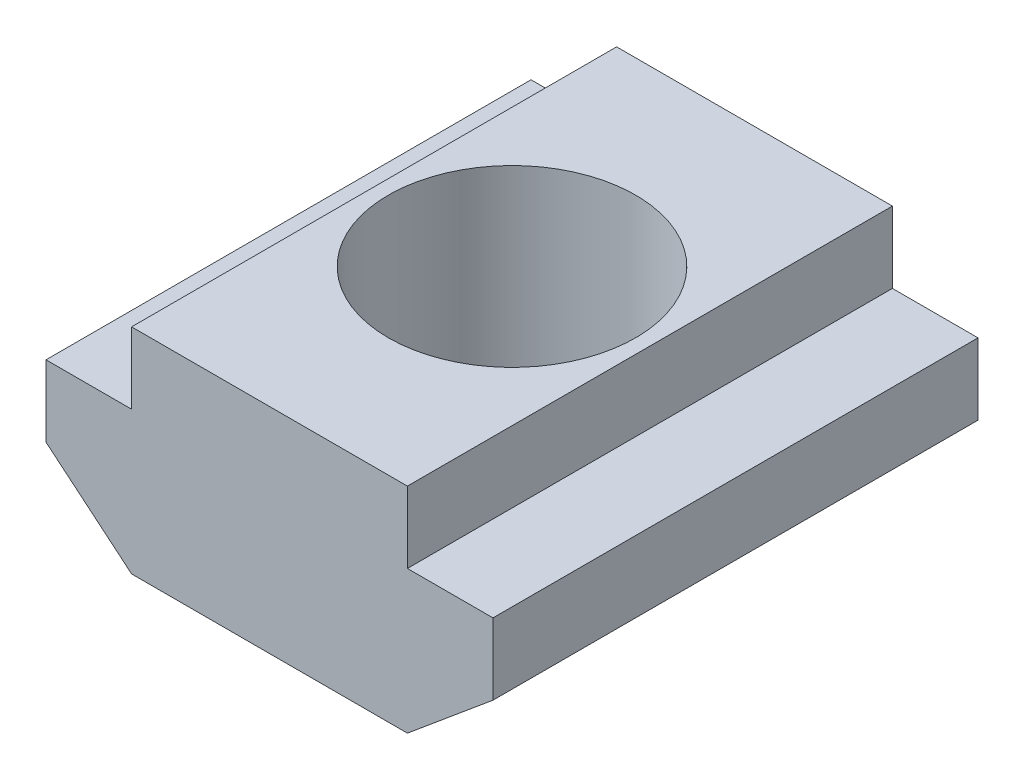
ISO-10303-21;
HEADER;
FILE_DESCRIPTION(('STEP AP214'),'2;1');
FILE_NAME('part.step','',(''),(''),'','','');
FILE_SCHEMA(('AUTOMOTIVE_DESIGN { 1 0 10303 214 1 1 1 1 }'));
ENDSEC;
DATA;
#1=APPLICATION_CONTEXT('core data for automotive mechanical design processes');
#2=APPLICATION_PROTOCOL_DEFINITION('international standard','automotive_design',2000,#1);
#3=PRODUCT_CONTEXT('',#1,'mechanical');
#4=PRODUCT('Part','Part','',(#3));
#5=PRODUCT_RELATED_PRODUCT_CATEGORY('part','',(#4));
#6=PRODUCT_DEFINITION_FORMATION('','',#4);
#7=PRODUCT_DEFINITION_CONTEXT('part definition',#1,'design');
#8=PRODUCT_DEFINITION('design','',#6,#7);
#9=PRODUCT_DEFINITION_SHAPE('','',#8);
#10=(LENGTH_UNIT() NAMED_UNIT(*) SI_UNIT(.MILLI.,.METRE.));
#11=(NAMED_UNIT(*) PLANE_ANGLE_UNIT() SI_UNIT($,.RADIAN.));
#12=(NAMED_UNIT(*) SI_UNIT($,.STERADIAN.) SOLID_ANGLE_UNIT());
#13=UNCERTAINTY_MEASURE_WITH_UNIT(LENGTH_MEASURE(1.E-05),#10,'distance_accuracy_value','');
#14=(GEOMETRIC_REPRESENTATION_CONTEXT(3) GLOBAL_UNCERTAINTY_ASSIGNED_CONTEXT((#13)) GLOBAL_UNIT_ASSIGNED_CONTEXT((#10,
#11,#12)) REPRESENTATION_CONTEXT('',''));
#15=CARTESIAN_POINT('',(0.,0.,0.));
#16=DIRECTION('',(0.,0.,1.));
#17=DIRECTION('',(1.,0.,0.));
#18=AXIS2_PLACEMENT_3D('',#15,#16,#17);
#19=CARTESIAN_POINT('',(1.8,3.,10.2));
#20=DIRECTION('',(0.,-1.,0.));
#21=DIRECTION('',(0.,0.,-1.));
#22=AXIS2_PLACEMENT_3D('',#19,#20,#21);
#23=PLANE('',#22);
#24=DIRECTION('',(-1.,0.,0.));
#25=VECTOR('',#24,1.);
#26=CARTESIAN_POINT('',(1.8,3.,0.));
#27=LINE('',#26,#25);
#28=CARTESIAN_POINT('',(1.8,3.,0.));
#29=VERTEX_POINT('',#28);
#30=CARTESIAN_POINT('',(0.,3.,0.));
#31=VERTEX_POINT('',#30);
#32=EDGE_CURVE('E143',#29,#31,#27,.T.);
#33=ORIENTED_EDGE('',*,*,#32,.T.);
#34=DIRECTION('',(0.,0.,-1.));
#35=VECTOR('',#34,1.);
#36=CARTESIAN_POINT('',(0.,3.,10.2));
#37=LINE('',#36,#35);
#38=CARTESIAN_POINT('',(0.,3.,10.2));
#39=VERTEX_POINT('',#38);
#40=EDGE_CURVE('E11',#39,#31,#37,.T.);
#41=ORIENTED_EDGE('',*,*,#40,.F.);
#42=DIRECTION('',(-1.,0.,0.));
#43=VECTOR('',#42,1.);
#44=CARTESIAN_POINT('',(1.8,3.,10.2));
#45=LINE('',#44,#43);
#46=CARTESIAN_POINT('',(1.8,3.,10.2));
#47=VERTEX_POINT('',#46);
#48=EDGE_CURVE('E162',#47,#39,#45,.T.);
#49=ORIENTED_EDGE('',*,*,#48,.F.);
#50=DIRECTION('',(0.,0.,-1.));
#51=VECTOR('',#50,1.);
#52=CARTESIAN_POINT('',(1.8,3.,10.2));
#53=LINE('',#52,#51);
#54=EDGE_CURVE('E139',#47,#29,#53,.T.);
#55=ORIENTED_EDGE('',*,*,#54,.T.);
#56=EDGE_LOOP('',(#33,#41,#49,#55));
#57=FACE_BOUND('',#56,.T.);
#58=ADVANCED_FACE('F35',(#57),#23,.F.);
#59=CARTESIAN_POINT('',(0.,3.,10.2));
#60=DIRECTION('',(1.,0.,0.));
#61=DIRECTION('',(0.,0.,-1.));
#62=AXIS2_PLACEMENT_3D('',#59,#60,#61);
#63=PLANE('',#62);
#64=DIRECTION('',(0.,-1.,0.));
#65=VECTOR('',#64,1.);
#66=CARTESIAN_POINT('',(0.,3.,0.));
#67=LINE('',#66,#65);
#68=CARTESIAN_POINT('',(0.,1.5,0.));
#69=VERTEX_POINT('',#68);
#70=EDGE_CURVE('E146',#31,#69,#67,.T.);
#71=ORIENTED_EDGE('',*,*,#70,.T.);
#72=DIRECTION('',(0.,0.,-1.));
#73=VECTOR('',#72,1.);
#74=CARTESIAN_POINT('',(0.,1.5,10.2));
#75=LINE('',#74,#73);
#76=CARTESIAN_POINT('',(0.,1.5,10.2));
#77=VERTEX_POINT('',#76);
#78=EDGE_CURVE('E43',#77,#69,#75,.T.);
#79=ORIENTED_EDGE('',*,*,#78,.F.);
#80=DIRECTION('',(0.,-1.,0.));
#81=VECTOR('',#80,1.);
#82=CARTESIAN_POINT('',(0.,3.,10.2));
#83=LINE('',#82,#81);
#84=EDGE_CURVE('E100',#39,#77,#83,.T.);
#85=ORIENTED_EDGE('',*,*,#84,.F.);
#86=ORIENTED_EDGE('',*,*,#40,.T.);
#87=EDGE_LOOP('',(#71,#79,#85,#86));
#88=FACE_BOUND('',#87,.T.);
#89=ADVANCED_FACE('F228',(#88),#63,.F.);
#90=CARTESIAN_POINT('',(0.,1.5,10.2));
#91=DIRECTION('',(0.64018439966448,0.768221279597376,0.));
#92=DIRECTION('',(-0.768221279597376,0.64018439966448,0.));
#93=AXIS2_PLACEMENT_3D('',#90,#91,#92);
#94=PLANE('',#93);
#95=DIRECTION('',(0.768221279597376,-0.64018439966448,0.));
#96=VECTOR('',#95,1.);
#97=CARTESIAN_POINT('',(0.,1.5,0.));
#98=LINE('',#97,#96);
#99=CARTESIAN_POINT('',(1.8,0.,0.));
#100=VERTEX_POINT('',#99);
#101=EDGE_CURVE('E149',#69,#100,#98,.T.);
#102=ORIENTED_EDGE('',*,*,#101,.T.);
#103=DIRECTION('',(0.,0.,-1.));
#104=VECTOR('',#103,1.);
#105=CARTESIAN_POINT('',(1.8,0.,10.2));
#106=LINE('',#105,#104);
#107=CARTESIAN_POINT('',(1.8,0.,10.2));
#108=VERTEX_POINT('',#107);
#109=EDGE_CURVE('E175',#108,#100,#106,.T.);
#110=ORIENTED_EDGE('',*,*,#109,.F.);
#111=DIRECTION('',(0.768221279597376,-0.64018439966448,0.));
#112=VECTOR('',#111,1.);
#113=CARTESIAN_POINT('',(0.,1.5,10.2));
#114=LINE('',#113,#112);
#115=EDGE_CURVE('E183',#77,#108,#114,.T.);
#116=ORIENTED_EDGE('',*,*,#115,.F.);
#117=ORIENTED_EDGE('',*,*,#78,.T.);
#118=EDGE_LOOP('',(#102,#110,#116,#117));
#119=FACE_BOUND('',#118,.T.);
#120=ADVANCED_FACE('F181',(#119),#94,.F.);
#121=CARTESIAN_POINT('',(1.8,0.,10.2));
#122=DIRECTION('',(0.,1.,0.));
#123=DIRECTION('',(0.,0.,1.));
#124=AXIS2_PLACEMENT_3D('',#121,#122,#123);
#125=PLANE('',#124);
#126=CARTESIAN_POINT('',(4.7,0.,5.1));
#127=DIRECTION('',(0.,1.,0.));
#128=DIRECTION('',(0.,0.,1.));
#129=AXIS2_PLACEMENT_3D('',#126,#127,#128);
#130=CIRCLE('',#129,2.6);
#131=CARTESIAN_POINT('',(4.7,0.,7.7));
#132=VERTEX_POINT('',#131);
#133=EDGE_CURVE('E147',#132,#132,#130,.T.);
#134=ORIENTED_EDGE('',*,*,#133,.T.);
#135=EDGE_LOOP('',(#134));
#136=FACE_BOUND('',#135,.T.);
#137=DIRECTION('',(1.,0.,0.));
#138=VECTOR('',#137,1.);
#139=CARTESIAN_POINT('',(1.8,0.,0.));
#140=LINE('',#139,#138);
#141=CARTESIAN_POINT('',(7.6,0.,0.));
#142=VERTEX_POINT('',#141);
#143=EDGE_CURVE('E151',#100,#142,#140,.T.);
#144=ORIENTED_EDGE('',*,*,#143,.T.);
#145=DIRECTION('',(0.,0.,-1.));
#146=VECTOR('',#145,1.);
#147=CARTESIAN_POINT('',(7.6,0.,10.2));
#148=LINE('',#147,#146);
#149=CARTESIAN_POINT('',(7.6,0.,10.2));
#150=VERTEX_POINT('',#149);
#151=EDGE_CURVE('E172',#150,#142,#148,.T.);
#152=ORIENTED_EDGE('',*,*,#151,.F.);
#153=DIRECTION('',(1.,0.,0.));
#154=VECTOR('',#153,1.);
#155=CARTESIAN_POINT('',(1.8,0.,10.2));
#156=LINE('',#155,#154);
#157=EDGE_CURVE('E201',#108,#150,#156,.T.);
#158=ORIENTED_EDGE('',*,*,#157,.F.);
#159=ORIENTED_EDGE('',*,*,#109,.T.);
#160=EDGE_LOOP('',(#144,#152,#158,#159));
#161=FACE_BOUND('',#160,.T.);
#162=ADVANCED_FACE('F192',(#136,#161),#125,.F.);
#163=CARTESIAN_POINT('',(7.6,0.,10.2));
#164=DIRECTION('',(-0.64018439966448,0.768221279597376,0.));
#165=DIRECTION('',(-0.768221279597376,-0.64018439966448,0.));
#166=AXIS2_PLACEMENT_3D('',#163,#164,#165);
#167=PLANE('',#166);
#168=DIRECTION('',(0.768221279597376,0.64018439966448,0.));
#169=VECTOR('',#168,1.);
#170=CARTESIAN_POINT('',(7.6,0.,0.));
#171=LINE('',#170,#169);
#172=CARTESIAN_POINT('',(9.4,1.5,0.));
#173=VERTEX_POINT('',#172);
#174=EDGE_CURVE('E153',#142,#173,#171,.T.);
#175=ORIENTED_EDGE('',*,*,#174,.T.);
#176=DIRECTION('',(0.,0.,-1.));
#177=VECTOR('',#176,1.);
#178=CARTESIAN_POINT('',(9.4,1.5,10.2));
#179=LINE('',#178,#177);
#180=CARTESIAN_POINT('',(9.4,1.5,10.2));
#181=VERTEX_POINT('',#180);
#182=EDGE_CURVE('E169',#181,#173,#179,.T.);
#183=ORIENTED_EDGE('',*,*,#182,.F.);
#184=DIRECTION('',(0.768221279597376,0.64018439966448,0.));
#185=VECTOR('',#184,1.);
#186=CARTESIAN_POINT('',(7.6,0.,10.2));
#187=LINE('',#186,#185);
#188=EDGE_CURVE('E198',#150,#181,#187,.T.);
#189=ORIENTED_EDGE('',*,*,#188,.F.);
#190=ORIENTED_EDGE('',*,*,#151,.T.);
#191=EDGE_LOOP('',(#175,#183,#189,#190));
#192=FACE_BOUND('',#191,.T.);
#193=ADVANCED_FACE('F196',(#192),#167,.F.);
#194=CARTESIAN_POINT('',(9.4,1.5,10.2));
#195=DIRECTION('',(-1.,0.,0.));
#196=DIRECTION('',(0.,0.,1.));
#197=AXIS2_PLACEMENT_3D('',#194,#195,#196);
#198=PLANE('',#197);
#199=DIRECTION('',(0.,1.,0.));
#200=VECTOR('',#199,1.);
#201=CARTESIAN_POINT('',(9.4,1.5,0.));
#202=LINE('',#201,#200);
#203=CARTESIAN_POINT('',(9.4,3.,0.));
#204=VERTEX_POINT('',#203);
#205=EDGE_CURVE('E155',#173,#204,#202,.T.);
#206=ORIENTED_EDGE('',*,*,#205,.T.);
#207=DIRECTION('',(0.,0.,-1.));
#208=VECTOR('',#207,1.);
#209=CARTESIAN_POINT('',(9.4,3.,10.2));
#210=LINE('',#209,#208);
#211=CARTESIAN_POINT('',(9.4,3.,10.2));
#212=VERTEX_POINT('',#211);
#213=EDGE_CURVE('E166',#212,#204,#210,.T.);
#214=ORIENTED_EDGE('',*,*,#213,.F.);
#215=DIRECTION('',(0.,1.,0.));
#216=VECTOR('',#215,1.);
#217=CARTESIAN_POINT('',(9.4,1.5,10.2));
#218=LINE('',#217,#216);
#219=EDGE_CURVE('E200',#181,#212,#218,.T.);
#220=ORIENTED_EDGE('',*,*,#219,.F.);
#221=ORIENTED_EDGE('',*,*,#182,.T.);
#222=EDGE_LOOP('',(#206,#214,#220,#221));
#223=FACE_BOUND('',#222,.T.);
#224=ADVANCED_FACE('F239',(#223),#198,.F.);
#225=CARTESIAN_POINT('',(9.4,3.,10.2));
#226=DIRECTION('',(0.,-1.,0.));
#227=DIRECTION('',(0.,0.,-1.));
#228=AXIS2_PLACEMENT_3D('',#225,#226,#227);
#229=PLANE('',#228);
#230=DIRECTION('',(-1.,0.,0.));
#231=VECTOR('',#230,1.);
#232=CARTESIAN_POINT('',(9.4,3.,0.));
#233=LINE('',#232,#231);
#234=CARTESIAN_POINT('',(7.6,3.,0.));
#235=VERTEX_POINT('',#234);
#236=EDGE_CURVE('E157',#204,#235,#233,.T.);
#237=ORIENTED_EDGE('',*,*,#236,.T.);
#238=DIRECTION('',(0.,0.,-1.));
#239=VECTOR('',#238,1.);
#240=CARTESIAN_POINT('',(7.6,3.,10.2));
#241=LINE('',#240,#239);
#242=CARTESIAN_POINT('',(7.6,3.,10.2));
#243=VERTEX_POINT('',#242);
#244=EDGE_CURVE('E134',#243,#235,#241,.T.);
#245=ORIENTED_EDGE('',*,*,#244,.F.);
#246=DIRECTION('',(-1.,0.,0.));
#247=VECTOR('',#246,1.);
#248=CARTESIAN_POINT('',(9.4,3.,10.2));
#249=LINE('',#248,#247);
#250=EDGE_CURVE('E125',#212,#243,#249,.T.);
#251=ORIENTED_EDGE('',*,*,#250,.F.);
#252=ORIENTED_EDGE('',*,*,#213,.T.);
#253=EDGE_LOOP('',(#237,#245,#251,#252));
#254=FACE_BOUND('',#253,.T.);
#255=ADVANCED_FACE('F225',(#254),#229,.F.);
#256=CARTESIAN_POINT('',(7.6,3.,10.2));
#257=DIRECTION('',(-1.,0.,0.));
#258=DIRECTION('',(0.,-1.,0.));
#259=AXIS2_PLACEMENT_3D('',#256,#257,#258);
#260=PLANE('',#259);
#261=DIRECTION('',(0.,1.,0.));
#262=VECTOR('',#261,1.);
#263=CARTESIAN_POINT('',(7.6,3.,0.));
#264=LINE('',#263,#262);
#265=CARTESIAN_POINT('',(7.6,4.5,0.));
#266=VERTEX_POINT('',#265);
#267=EDGE_CURVE('E133',#235,#266,#264,.T.);
#268=ORIENTED_EDGE('',*,*,#267,.T.);
#269=DIRECTION('',(0.,0.,-1.));
#270=VECTOR('',#269,1.);
#271=CARTESIAN_POINT('',(7.6,4.5,10.2));
#272=LINE('',#271,#270);
#273=CARTESIAN_POINT('',(7.6,4.5,10.2));
#274=VERTEX_POINT('',#273);
#275=EDGE_CURVE('E130',#274,#266,#272,.T.);
#276=ORIENTED_EDGE('',*,*,#275,.F.);
#277=DIRECTION('',(0.,1.,0.));
#278=VECTOR('',#277,1.);
#279=CARTESIAN_POINT('',(7.6,3.,10.2));
#280=LINE('',#279,#278);
#281=EDGE_CURVE('E119',#243,#274,#280,.T.);
#282=ORIENTED_EDGE('',*,*,#281,.F.);
#283=ORIENTED_EDGE('',*,*,#244,.T.);
#284=EDGE_LOOP('',(#268,#276,#282,#283));
#285=FACE_BOUND('',#284,.T.);
#286=ADVANCED_FACE('F131',(#285),#260,.F.);
#287=CARTESIAN_POINT('',(7.6,4.5,10.2));
#288=DIRECTION('',(0.,-1.,0.));
#289=DIRECTION('',(0.,0.,-1.));
#290=AXIS2_PLACEMENT_3D('',#287,#288,#289);
#291=PLANE('',#290);
#292=CARTESIAN_POINT('',(4.7,4.5,5.1));
#293=DIRECTION('',(0.,1.,0.));
#294=DIRECTION('',(0.,0.,1.));
#295=AXIS2_PLACEMENT_3D('',#292,#293,#294);
#296=CIRCLE('',#295,2.59999999999999);
#297=CARTESIAN_POINT('',(4.7,4.5,7.69999999999999));
#298=VERTEX_POINT('',#297);
#299=EDGE_CURVE('E211',#298,#298,#296,.T.);
#300=ORIENTED_EDGE('',*,*,#299,.F.);
#301=EDGE_LOOP('',(#300));
#302=FACE_BOUND('',#301,.T.);
#303=DIRECTION('',(-1.,0.,0.));
#304=VECTOR('',#303,1.);
#305=CARTESIAN_POINT('',(7.6,4.5,0.));
#306=LINE('',#305,#304);
#307=CARTESIAN_POINT('',(1.8,4.5,0.));
#308=VERTEX_POINT('',#307);
#309=EDGE_CURVE('E86',#266,#308,#306,.T.);
#310=ORIENTED_EDGE('',*,*,#309,.T.);
#311=DIRECTION('',(0.,0.,-1.));
#312=VECTOR('',#311,1.);
#313=CARTESIAN_POINT('',(1.8,4.5,10.2));
#314=LINE('',#313,#312);
#315=CARTESIAN_POINT('',(1.8,4.5,10.2));
#316=VERTEX_POINT('',#315);
#317=EDGE_CURVE('E135',#316,#308,#314,.T.);
#318=ORIENTED_EDGE('',*,*,#317,.F.);
#319=DIRECTION('',(-1.,0.,0.));
#320=VECTOR('',#319,1.);
#321=CARTESIAN_POINT('',(7.6,4.5,10.2));
#322=LINE('',#321,#320);
#323=EDGE_CURVE('E123',#274,#316,#322,.T.);
#324=ORIENTED_EDGE('',*,*,#323,.F.);
#325=ORIENTED_EDGE('',*,*,#275,.T.);
#326=EDGE_LOOP('',(#310,#318,#324,#325));
#327=FACE_BOUND('',#326,.T.);
#328=ADVANCED_FACE('F137',(#302,#327),#291,.F.);
#329=CARTESIAN_POINT('',(1.8,4.5,10.2));
#330=DIRECTION('',(1.,0.,0.));
#331=DIRECTION('',(0.,0.,-1.));
#332=AXIS2_PLACEMENT_3D('',#329,#330,#331);
#333=PLANE('',#332);
#334=DIRECTION('',(0.,-1.,0.));
#335=VECTOR('',#334,1.);
#336=CARTESIAN_POINT('',(1.8,4.5,0.));
#337=LINE('',#336,#335);
#338=EDGE_CURVE('E92',#308,#29,#337,.T.);
#339=ORIENTED_EDGE('',*,*,#338,.T.);
#340=ORIENTED_EDGE('',*,*,#54,.F.);
#341=DIRECTION('',(0.,-1.,0.));
#342=VECTOR('',#341,1.);
#343=CARTESIAN_POINT('',(1.8,4.5,10.2));
#344=LINE('',#343,#342);
#345=EDGE_CURVE('E51',#316,#47,#344,.T.);
#346=ORIENTED_EDGE('',*,*,#345,.F.);
#347=ORIENTED_EDGE('',*,*,#317,.T.);
#348=EDGE_LOOP('',(#339,#340,#346,#347));
#349=FACE_BOUND('',#348,.T.);
#350=ADVANCED_FACE('F218',(#349),#333,.F.);
#351=CARTESIAN_POINT('',(0.,0.,10.2));
#352=DIRECTION('',(0.,0.,1.));
#353=DIRECTION('',(1.,0.,0.));
#354=AXIS2_PLACEMENT_3D('',#351,#352,#353);
#355=PLANE('',#354);
#356=ORIENTED_EDGE('',*,*,#48,.T.);
#357=ORIENTED_EDGE('',*,*,#84,.T.);
#358=ORIENTED_EDGE('',*,*,#115,.T.);
#359=ORIENTED_EDGE('',*,*,#157,.T.);
#360=ORIENTED_EDGE('',*,*,#188,.T.);
#361=ORIENTED_EDGE('',*,*,#219,.T.);
#362=ORIENTED_EDGE('',*,*,#250,.T.);
#363=ORIENTED_EDGE('',*,*,#281,.T.);
#364=ORIENTED_EDGE('',*,*,#323,.T.);
#365=ORIENTED_EDGE('',*,*,#345,.T.);
#366=EDGE_LOOP('',(#356,#357,#358,#359,#360,#361,#362,#363,#364,#365));
#367=FACE_BOUND('',#366,.T.);
#368=ADVANCED_FACE('F121',(#367),#355,.T.);
#369=CARTESIAN_POINT('',(0.,0.,0.));
#370=DIRECTION('',(0.,0.,1.));
#371=DIRECTION('',(1.,0.,0.));
#372=AXIS2_PLACEMENT_3D('',#369,#370,#371);
#373=PLANE('',#372);
#374=ORIENTED_EDGE('',*,*,#32,.F.);
#375=ORIENTED_EDGE('',*,*,#338,.F.);
#376=ORIENTED_EDGE('',*,*,#309,.F.);
#377=ORIENTED_EDGE('',*,*,#267,.F.);
#378=ORIENTED_EDGE('',*,*,#236,.F.);
#379=ORIENTED_EDGE('',*,*,#205,.F.);
#380=ORIENTED_EDGE('',*,*,#174,.F.);
#381=ORIENTED_EDGE('',*,*,#143,.F.);
#382=ORIENTED_EDGE('',*,*,#101,.F.);
#383=ORIENTED_EDGE('',*,*,#70,.F.);
#384=EDGE_LOOP('',(#374,#375,#376,#377,#378,#379,#380,#381,#382,#383));
#385=FACE_BOUND('',#384,.T.);
#386=ADVANCED_FACE('F187',(#385),#373,.F.);
#387=CARTESIAN_POINT('',(4.7,4.5,5.1));
#388=DIRECTION('',(0.,1.,0.));
#389=DIRECTION('',(0.,0.,1.));
#390=AXIS2_PLACEMENT_3D('',#387,#388,#389);
#391=CYLINDRICAL_SURFACE('',#390,2.59999999999999);
#392=ORIENTED_EDGE('',*,*,#133,.F.);
#393=EDGE_LOOP('',(#392));
#394=FACE_BOUND('',#393,.T.);
#395=ORIENTED_EDGE('',*,*,#299,.T.);
#396=EDGE_LOOP('',(#395));
#397=FACE_BOUND('',#396,.T.);
#398=ADVANCED_FACE('F215',(#394,#397),#391,.F.);
#399=CLOSED_SHELL('',(#58,#89,#120,#162,#193,#224,#255,#286,#328,#350,#368,#386,#398));
#400=MANIFOLD_SOLID_BREP('B2',#399);
#401=ADVANCED_BREP_SHAPE_REPRESENTATION('',(#18,#400),#14);
#402=SHAPE_DEFINITION_REPRESENTATION(#9,#401);
ENDSEC;
END-ISO-10303-21;
